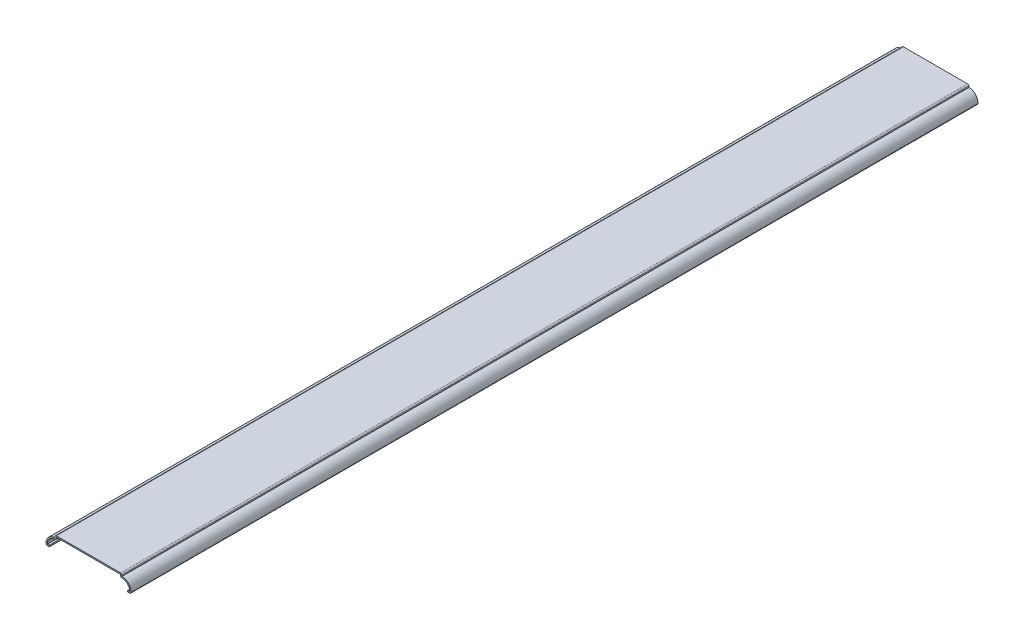
ISO-10303-21;
HEADER;
FILE_DESCRIPTION(('STEP AP214'),'2;1');
FILE_NAME('part.step','',(''),(''),'','','');
FILE_SCHEMA(('AUTOMOTIVE_DESIGN { 1 0 10303 214 1 1 1 1 }'));
ENDSEC;
DATA;
#1=APPLICATION_CONTEXT('core data for automotive mechanical design processes');
#2=APPLICATION_PROTOCOL_DEFINITION('international standard','automotive_design',2000,#1);
#3=PRODUCT_CONTEXT('',#1,'mechanical');
#4=PRODUCT('Part','Part','',(#3));
#5=PRODUCT_RELATED_PRODUCT_CATEGORY('part','',(#4));
#6=PRODUCT_DEFINITION_FORMATION('','',#4);
#7=PRODUCT_DEFINITION_CONTEXT('part definition',#1,'design');
#8=PRODUCT_DEFINITION('design','',#6,#7);
#9=PRODUCT_DEFINITION_SHAPE('','',#8);
#10=(LENGTH_UNIT() NAMED_UNIT(*) SI_UNIT(.MILLI.,.METRE.));
#11=(NAMED_UNIT(*) PLANE_ANGLE_UNIT() SI_UNIT($,.RADIAN.));
#12=(NAMED_UNIT(*) SI_UNIT($,.STERADIAN.) SOLID_ANGLE_UNIT());
#13=UNCERTAINTY_MEASURE_WITH_UNIT(LENGTH_MEASURE(1.E-05),#10,'distance_accuracy_value','');
#14=(GEOMETRIC_REPRESENTATION_CONTEXT(3) GLOBAL_UNCERTAINTY_ASSIGNED_CONTEXT((#13)) GLOBAL_UNIT_ASSIGNED_CONTEXT((#10,
#11,#12)) REPRESENTATION_CONTEXT('',''));
#15=CARTESIAN_POINT('',(0.,0.,0.));
#16=DIRECTION('',(0.,0.,1.));
#17=DIRECTION('',(1.,0.,0.));
#18=AXIS2_PLACEMENT_3D('',#15,#16,#17);
#19=CARTESIAN_POINT('',(-38.1,0.,-825.5));
#20=DIRECTION('',(0.,-1.,0.));
#21=DIRECTION('',(1.,0.,0.));
#22=AXIS2_PLACEMENT_3D('',#19,#20,#21);
#23=PLANE('',#22);
#24=DIRECTION('',(1.,0.,0.));
#25=VECTOR('',#24,1.);
#26=CARTESIAN_POINT('',(-38.1,0.,0.));
#27=LINE('',#26,#25);
#28=CARTESIAN_POINT('',(-40.1439457789629,0.,0.));
#29=VERTEX_POINT('',#28);
#30=CARTESIAN_POINT('',(-38.1,0.,0.));
#31=VERTEX_POINT('',#30);
#32=EDGE_CURVE('E329',#29,#31,#27,.T.);
#33=ORIENTED_EDGE('',*,*,#32,.F.);
#34=DIRECTION('',(0.,0.,1.));
#35=VECTOR('',#34,1.);
#36=CARTESIAN_POINT('',(-40.1439457789629,0.,-825.5));
#37=LINE('',#36,#35);
#38=CARTESIAN_POINT('',(-40.1439457789629,0.,-825.5));
#39=VERTEX_POINT('',#38);
#40=EDGE_CURVE('E193',#29,#39,#37,.F.);
#41=ORIENTED_EDGE('',*,*,#40,.T.);
#42=DIRECTION('',(1.,0.,0.));
#43=VECTOR('',#42,1.);
#44=CARTESIAN_POINT('',(-38.1,0.,-825.5));
#45=LINE('',#44,#43);
#46=CARTESIAN_POINT('',(-38.1,0.,-825.5));
#47=VERTEX_POINT('',#46);
#48=EDGE_CURVE('E186',#39,#47,#45,.T.);
#49=ORIENTED_EDGE('',*,*,#48,.T.);
#50=DIRECTION('',(0.,0.,1.));
#51=VECTOR('',#50,1.);
#52=CARTESIAN_POINT('',(-38.1,0.,-825.5));
#53=LINE('',#52,#51);
#54=EDGE_CURVE('E190',#47,#31,#53,.T.);
#55=ORIENTED_EDGE('',*,*,#54,.T.);
#56=EDGE_LOOP('',(#33,#41,#49,#55));
#57=FACE_BOUND('',#56,.T.);
#58=ADVANCED_FACE('F35',(#57),#23,.T.);
#59=CARTESIAN_POINT('',(-32.6895060790985,1.5887166823141,-825.5));
#60=DIRECTION('',(0.,0.,1.));
#61=DIRECTION('',(1.,0.,0.));
#62=AXIS2_PLACEMENT_3D('',#59,#60,#61);
#63=CYLINDRICAL_SURFACE('',#62,8.73125000000001);
#64=CARTESIAN_POINT('',(-32.6895060790985,1.5887166823141,-825.5));
#65=DIRECTION('',(0.,0.,1.));
#66=DIRECTION('',(-1.,0.,0.));
#67=AXIS2_PLACEMENT_3D('',#64,#65,#66);
#68=CIRCLE('',#67,8.73125000000001);
#69=CARTESIAN_POINT('',(-32.54375,10.31875,-825.5));
#70=VERTEX_POINT('',#69);
#71=CARTESIAN_POINT('',(-41.4127865789398,1.21575035194653,-825.5));
#72=VERTEX_POINT('',#71);
#73=EDGE_CURVE('E210',#70,#72,#68,.T.);
#74=ORIENTED_EDGE('',*,*,#73,.T.);
#75=DIRECTION('',(0.,0.,1.));
#76=VECTOR('',#75,1.);
#77=CARTESIAN_POINT('',(-41.4127865789398,1.21575035194653,-825.5));
#78=LINE('',#77,#76);
#79=CARTESIAN_POINT('',(-41.4127865789398,1.21575035194653,0.));
#80=VERTEX_POINT('',#79);
#81=EDGE_CURVE('E219',#72,#80,#78,.T.);
#82=ORIENTED_EDGE('',*,*,#81,.T.);
#83=CARTESIAN_POINT('',(-32.6895060790985,1.5887166823141,0.));
#84=DIRECTION('',(0.,0.,1.));
#85=DIRECTION('',(-1.,0.,0.));
#86=AXIS2_PLACEMENT_3D('',#83,#84,#85);
#87=CIRCLE('',#86,8.73125000000001);
#88=CARTESIAN_POINT('',(-32.54375,10.31875,0.));
#89=VERTEX_POINT('',#88);
#90=EDGE_CURVE('E196',#89,#80,#87,.T.);
#91=ORIENTED_EDGE('',*,*,#90,.F.);
#92=DIRECTION('',(0.,0.,1.));
#93=VECTOR('',#92,1.);
#94=CARTESIAN_POINT('',(-32.54375,10.31875,-825.5));
#95=LINE('',#94,#93);
#96=EDGE_CURVE('E223',#70,#89,#95,.T.);
#97=ORIENTED_EDGE('',*,*,#96,.F.);
#98=EDGE_LOOP('',(#74,#82,#91,#97));
#99=FACE_BOUND('',#98,.T.);
#100=ADVANCED_FACE('F370',(#99),#63,.T.);
#101=CARTESIAN_POINT('',(-32.54375,10.31875,-825.5));
#102=DIRECTION('',(-1.,0.,0.));
#103=DIRECTION('',(0.,0.,1.));
#104=AXIS2_PLACEMENT_3D('',#101,#102,#103);
#105=PLANE('',#104);
#106=DIRECTION('',(0.,-1.,0.));
#107=VECTOR('',#106,1.);
#108=CARTESIAN_POINT('',(-32.54375,10.31875,0.));
#109=LINE('',#108,#107);
#110=CARTESIAN_POINT('',(-32.54375,11.43,0.));
#111=VERTEX_POINT('',#110);
#112=EDGE_CURVE('E272',#111,#89,#109,.T.);
#113=ORIENTED_EDGE('',*,*,#112,.F.);
#114=DIRECTION('',(0.,0.,1.));
#115=VECTOR('',#114,1.);
#116=CARTESIAN_POINT('',(-32.54375,11.43,-825.5));
#117=LINE('',#116,#115);
#118=CARTESIAN_POINT('',(-32.54375,11.43,-825.5));
#119=VERTEX_POINT('',#118);
#120=EDGE_CURVE('E43',#111,#119,#117,.F.);
#121=ORIENTED_EDGE('',*,*,#120,.T.);
#122=DIRECTION('',(0.,-1.,0.));
#123=VECTOR('',#122,1.);
#124=CARTESIAN_POINT('',(-32.54375,10.31875,-825.5));
#125=LINE('',#124,#123);
#126=EDGE_CURVE('E215',#119,#70,#125,.T.);
#127=ORIENTED_EDGE('',*,*,#126,.T.);
#128=ORIENTED_EDGE('',*,*,#96,.T.);
#129=EDGE_LOOP('',(#113,#121,#127,#128));
#130=FACE_BOUND('',#129,.T.);
#131=ADVANCED_FACE('F269',(#130),#105,.T.);
#132=CARTESIAN_POINT('',(-32.54375,12.7,-825.5));
#133=DIRECTION('',(0.,1.,0.));
#134=DIRECTION('',(0.,0.,1.));
#135=AXIS2_PLACEMENT_3D('',#132,#133,#134);
#136=PLANE('',#135);
#137=DIRECTION('',(-1.,0.,0.));
#138=VECTOR('',#137,1.);
#139=CARTESIAN_POINT('',(-32.54375,12.7,-825.5));
#140=LINE('',#139,#138);
#141=CARTESIAN_POINT('',(31.27375,12.7,-825.5));
#142=VERTEX_POINT('',#141);
#143=CARTESIAN_POINT('',(-31.27375,12.7,-825.5));
#144=VERTEX_POINT('',#143);
#145=EDGE_CURVE('E278',#142,#144,#140,.T.);
#146=ORIENTED_EDGE('',*,*,#145,.T.);
#147=DIRECTION('',(0.,0.,1.));
#148=VECTOR('',#147,1.);
#149=CARTESIAN_POINT('',(-31.27375,12.7,-825.5));
#150=LINE('',#149,#148);
#151=CARTESIAN_POINT('',(-31.27375,12.7,0.));
#152=VERTEX_POINT('',#151);
#153=EDGE_CURVE('E263',#144,#152,#150,.T.);
#154=ORIENTED_EDGE('',*,*,#153,.T.);
#155=DIRECTION('',(-1.,0.,0.));
#156=VECTOR('',#155,1.);
#157=CARTESIAN_POINT('',(-32.54375,12.7,0.));
#158=LINE('',#157,#156);
#159=CARTESIAN_POINT('',(31.27375,12.7,0.));
#160=VERTEX_POINT('',#159);
#161=EDGE_CURVE('E286',#160,#152,#158,.T.);
#162=ORIENTED_EDGE('',*,*,#161,.F.);
#163=DIRECTION('',(0.,0.,1.));
#164=VECTOR('',#163,1.);
#165=CARTESIAN_POINT('',(31.27375,12.7,-825.5));
#166=LINE('',#165,#164);
#167=EDGE_CURVE('E261',#160,#142,#166,.F.);
#168=ORIENTED_EDGE('',*,*,#167,.T.);
#169=EDGE_LOOP('',(#146,#154,#162,#168));
#170=FACE_BOUND('',#169,.T.);
#171=ADVANCED_FACE('F285',(#170),#136,.T.);
#172=CARTESIAN_POINT('',(32.54375,10.31875,-825.5));
#173=DIRECTION('',(1.,0.,0.));
#174=DIRECTION('',(0.,0.,-1.));
#175=AXIS2_PLACEMENT_3D('',#172,#173,#174);
#176=PLANE('',#175);
#177=DIRECTION('',(0.,1.,0.));
#178=VECTOR('',#177,1.);
#179=CARTESIAN_POINT('',(32.54375,10.31875,-825.5));
#180=LINE('',#179,#178);
#181=CARTESIAN_POINT('',(32.54375,10.31875,-825.5));
#182=VERTEX_POINT('',#181);
#183=CARTESIAN_POINT('',(32.54375,11.43,-825.5));
#184=VERTEX_POINT('',#183);
#185=EDGE_CURVE('E360',#182,#184,#180,.T.);
#186=ORIENTED_EDGE('',*,*,#185,.T.);
#187=DIRECTION('',(0.,0.,1.));
#188=VECTOR('',#187,1.);
#189=CARTESIAN_POINT('',(32.54375,11.43,-825.5));
#190=LINE('',#189,#188);
#191=CARTESIAN_POINT('',(32.54375,11.43,0.));
#192=VERTEX_POINT('',#191);
#193=EDGE_CURVE('E11',#184,#192,#190,.T.);
#194=ORIENTED_EDGE('',*,*,#193,.T.);
#195=DIRECTION('',(0.,1.,0.));
#196=VECTOR('',#195,1.);
#197=CARTESIAN_POINT('',(32.54375,10.31875,0.));
#198=LINE('',#197,#196);
#199=CARTESIAN_POINT('',(32.54375,10.31875,0.));
#200=VERTEX_POINT('',#199);
#201=EDGE_CURVE('E292',#200,#192,#198,.T.);
#202=ORIENTED_EDGE('',*,*,#201,.F.);
#203=DIRECTION('',(0.,0.,1.));
#204=VECTOR('',#203,1.);
#205=CARTESIAN_POINT('',(32.54375,10.31875,-825.5));
#206=LINE('',#205,#204);
#207=EDGE_CURVE('E301',#182,#200,#206,.T.);
#208=ORIENTED_EDGE('',*,*,#207,.F.);
#209=EDGE_LOOP('',(#186,#194,#202,#208));
#210=FACE_BOUND('',#209,.T.);
#211=ADVANCED_FACE('F358',(#210),#176,.T.);
#212=CARTESIAN_POINT('',(32.6895060790985,1.5887166823141,-825.5));
#213=DIRECTION('',(0.,0.,1.));
#214=DIRECTION('',(1.,0.,0.));
#215=AXIS2_PLACEMENT_3D('',#212,#213,#214);
#216=CYLINDRICAL_SURFACE('',#215,8.73125000000001);
#217=CARTESIAN_POINT('',(32.6895060790985,1.5887166823141,0.));
#218=DIRECTION('',(0.,0.,1.));
#219=DIRECTION('',(1.,0.,0.));
#220=AXIS2_PLACEMENT_3D('',#217,#218,#219);
#221=CIRCLE('',#220,8.73125000000001);
#222=CARTESIAN_POINT('',(41.4127865789398,1.21575035194653,0.));
#223=VERTEX_POINT('',#222);
#224=EDGE_CURVE('E295',#223,#200,#221,.T.);
#225=ORIENTED_EDGE('',*,*,#224,.F.);
#226=DIRECTION('',(0.,0.,1.));
#227=VECTOR('',#226,1.);
#228=CARTESIAN_POINT('',(41.4127865789398,1.21575035194653,-825.5));
#229=LINE('',#228,#227);
#230=CARTESIAN_POINT('',(41.4127865789398,1.21575035194653,-825.5));
#231=VERTEX_POINT('',#230);
#232=EDGE_CURVE('E250',#223,#231,#229,.F.);
#233=ORIENTED_EDGE('',*,*,#232,.T.);
#234=CARTESIAN_POINT('',(32.6895060790985,1.5887166823141,-825.5));
#235=DIRECTION('',(0.,0.,1.));
#236=DIRECTION('',(1.,0.,0.));
#237=AXIS2_PLACEMENT_3D('',#234,#235,#236);
#238=CIRCLE('',#237,8.73125000000001);
#239=EDGE_CURVE('E354',#231,#182,#238,.T.);
#240=ORIENTED_EDGE('',*,*,#239,.T.);
#241=ORIENTED_EDGE('',*,*,#207,.T.);
#242=EDGE_LOOP('',(#225,#233,#240,#241));
#243=FACE_BOUND('',#242,.T.);
#244=ADVANCED_FACE('F352',(#243),#216,.T.);
#245=CARTESIAN_POINT('',(38.1,0.,-825.5));
#246=DIRECTION('',(0.,-1.,0.));
#247=DIRECTION('',(1.,0.,0.));
#248=AXIS2_PLACEMENT_3D('',#245,#246,#247);
#249=PLANE('',#248);
#250=DIRECTION('',(1.,0.,0.));
#251=VECTOR('',#250,1.);
#252=CARTESIAN_POINT('',(38.1,0.,-825.5));
#253=LINE('',#252,#251);
#254=CARTESIAN_POINT('',(38.1,0.,-825.5));
#255=VERTEX_POINT('',#254);
#256=CARTESIAN_POINT('',(40.1439457789629,0.,-825.5));
#257=VERTEX_POINT('',#256);
#258=EDGE_CURVE('E602',#255,#257,#253,.T.);
#259=ORIENTED_EDGE('',*,*,#258,.T.);
#260=DIRECTION('',(0.,0.,1.));
#261=VECTOR('',#260,1.);
#262=CARTESIAN_POINT('',(40.1439457789629,0.,-825.5));
#263=LINE('',#262,#261);
#264=CARTESIAN_POINT('',(40.1439457789629,0.,0.));
#265=VERTEX_POINT('',#264);
#266=EDGE_CURVE('E247',#257,#265,#263,.T.);
#267=ORIENTED_EDGE('',*,*,#266,.T.);
#268=DIRECTION('',(1.,0.,0.));
#269=VECTOR('',#268,1.);
#270=CARTESIAN_POINT('',(38.1,0.,0.));
#271=LINE('',#270,#269);
#272=CARTESIAN_POINT('',(38.1,0.,0.));
#273=VERTEX_POINT('',#272);
#274=EDGE_CURVE('E345',#273,#265,#271,.T.);
#275=ORIENTED_EDGE('',*,*,#274,.F.);
#276=DIRECTION('',(0.,0.,1.));
#277=VECTOR('',#276,1.);
#278=CARTESIAN_POINT('',(38.1,0.,-825.5));
#279=LINE('',#278,#277);
#280=EDGE_CURVE('E304',#255,#273,#279,.T.);
#281=ORIENTED_EDGE('',*,*,#280,.F.);
#282=EDGE_LOOP('',(#259,#267,#275,#281));
#283=FACE_BOUND('',#282,.T.);
#284=ADVANCED_FACE('F389',(#283),#249,.T.);
#285=CARTESIAN_POINT('',(38.1,0.,-825.5));
#286=DIRECTION('',(1.,0.,0.));
#287=DIRECTION('',(0.,0.,-1.));
#288=AXIS2_PLACEMENT_3D('',#285,#286,#287);
#289=PLANE('',#288);
#290=DIRECTION('',(0.,1.,0.));
#291=VECTOR('',#290,1.);
#292=CARTESIAN_POINT('',(38.1,0.,0.));
#293=LINE('',#292,#291);
#294=CARTESIAN_POINT('',(38.1,1.27,0.));
#295=VERTEX_POINT('',#294);
#296=EDGE_CURVE('E343',#273,#295,#293,.T.);
#297=ORIENTED_EDGE('',*,*,#296,.T.);
#298=DIRECTION('',(0.,0.,1.));
#299=VECTOR('',#298,1.);
#300=CARTESIAN_POINT('',(38.1,1.27,-825.5));
#301=LINE('',#300,#299);
#302=CARTESIAN_POINT('',(38.1,1.27,-825.5));
#303=VERTEX_POINT('',#302);
#304=EDGE_CURVE('E306',#303,#295,#301,.T.);
#305=ORIENTED_EDGE('',*,*,#304,.F.);
#306=DIRECTION('',(0.,1.,0.));
#307=VECTOR('',#306,1.);
#308=CARTESIAN_POINT('',(38.1,0.,-825.5));
#309=LINE('',#308,#307);
#310=EDGE_CURVE('E600',#255,#303,#309,.T.);
#311=ORIENTED_EDGE('',*,*,#310,.F.);
#312=ORIENTED_EDGE('',*,*,#280,.T.);
#313=EDGE_LOOP('',(#297,#305,#311,#312));
#314=FACE_BOUND('',#313,.T.);
#315=ADVANCED_FACE('F392',(#314),#289,.F.);
#316=CARTESIAN_POINT('',(38.1,1.27,-825.5));
#317=DIRECTION('',(0.,-1.,0.));
#318=DIRECTION('',(1.,0.,0.));
#319=AXIS2_PLACEMENT_3D('',#316,#317,#318);
#320=PLANE('',#319);
#321=DIRECTION('',(1.,0.,0.));
#322=VECTOR('',#321,1.);
#323=CARTESIAN_POINT('',(38.1,1.27,0.));
#324=LINE('',#323,#322);
#325=CARTESIAN_POINT('',(40.1439457789629,1.27,0.));
#326=VERTEX_POINT('',#325);
#327=EDGE_CURVE('E341',#295,#326,#324,.T.);
#328=ORIENTED_EDGE('',*,*,#327,.T.);
#329=DIRECTION('',(0.,0.,1.));
#330=VECTOR('',#329,1.);
#331=CARTESIAN_POINT('',(40.1439457789629,1.27,-825.5));
#332=LINE('',#331,#330);
#333=CARTESIAN_POINT('',(40.1439457789629,1.27,-825.5));
#334=VERTEX_POINT('',#333);
#335=EDGE_CURVE('E309',#334,#326,#332,.T.);
#336=ORIENTED_EDGE('',*,*,#335,.F.);
#337=DIRECTION('',(1.,0.,0.));
#338=VECTOR('',#337,1.);
#339=CARTESIAN_POINT('',(38.1,1.27,-825.5));
#340=LINE('',#339,#338);
#341=EDGE_CURVE('E598',#303,#334,#340,.T.);
#342=ORIENTED_EDGE('',*,*,#341,.F.);
#343=ORIENTED_EDGE('',*,*,#304,.T.);
#344=EDGE_LOOP('',(#328,#336,#342,#343));
#345=FACE_BOUND('',#344,.T.);
#346=ADVANCED_FACE('F396',(#345),#320,.F.);
#347=CARTESIAN_POINT('',(32.6895060790985,1.5887166823141,-825.5));
#348=DIRECTION('',(0.,0.,1.));
#349=DIRECTION('',(1.,0.,0.));
#350=AXIS2_PLACEMENT_3D('',#347,#348,#349);
#351=CYLINDRICAL_SURFACE('',#350,7.46125000000001);
#352=CARTESIAN_POINT('',(32.6895060790985,1.5887166823141,0.));
#353=DIRECTION('',(0.,0.,1.));
#354=DIRECTION('',(1.,0.,0.));
#355=AXIS2_PLACEMENT_3D('',#352,#353,#354);
#356=CIRCLE('',#355,7.46125000000001);
#357=CARTESIAN_POINT('',(32.5649508842325,9.04892697197296,0.));
#358=VERTEX_POINT('',#357);
#359=EDGE_CURVE('E338',#326,#358,#356,.T.);
#360=ORIENTED_EDGE('',*,*,#359,.T.);
#361=DIRECTION('',(0.,0.,1.));
#362=VECTOR('',#361,1.);
#363=CARTESIAN_POINT('',(32.5649508842325,9.04892697197296,-825.5));
#364=LINE('',#363,#362);
#365=CARTESIAN_POINT('',(32.5649508842325,9.04892697197296,-825.5));
#366=VERTEX_POINT('',#365);
#367=EDGE_CURVE('E255',#358,#366,#364,.F.);
#368=ORIENTED_EDGE('',*,*,#367,.T.);
#369=CARTESIAN_POINT('',(32.6895060790985,1.5887166823141,-825.5));
#370=DIRECTION('',(0.,0.,1.));
#371=DIRECTION('',(1.,0.,0.));
#372=AXIS2_PLACEMENT_3D('',#369,#370,#371);
#373=CIRCLE('',#372,7.46125000000001);
#374=EDGE_CURVE('E595',#334,#366,#373,.T.);
#375=ORIENTED_EDGE('',*,*,#374,.F.);
#376=ORIENTED_EDGE('',*,*,#335,.T.);
#377=EDGE_LOOP('',(#360,#368,#375,#376));
#378=FACE_BOUND('',#377,.T.);
#379=ADVANCED_FACE('F400',(#378),#351,.F.);
#380=CARTESIAN_POINT('',(31.27375,10.31875,-825.5));
#381=DIRECTION('',(1.,0.,0.));
#382=DIRECTION('',(0.,0.,-1.));
#383=AXIS2_PLACEMENT_3D('',#380,#381,#382);
#384=PLANE('',#383);
#385=DIRECTION('',(0.,1.,0.));
#386=VECTOR('',#385,1.);
#387=CARTESIAN_POINT('',(31.27375,10.31875,-825.5));
#388=LINE('',#387,#386);
#389=CARTESIAN_POINT('',(31.27375,10.31875,-825.5));
#390=VERTEX_POINT('',#389);
#391=CARTESIAN_POINT('',(31.27375,11.43,-825.5));
#392=VERTEX_POINT('',#391);
#393=EDGE_CURVE('E593',#390,#392,#388,.T.);
#394=ORIENTED_EDGE('',*,*,#393,.F.);
#395=DIRECTION('',(0.,0.,1.));
#396=VECTOR('',#395,1.);
#397=CARTESIAN_POINT('',(31.27375,10.31875,-825.5));
#398=LINE('',#397,#396);
#399=CARTESIAN_POINT('',(31.27375,10.31875,0.));
#400=VERTEX_POINT('',#399);
#401=EDGE_CURVE('E252',#390,#400,#398,.T.);
#402=ORIENTED_EDGE('',*,*,#401,.T.);
#403=DIRECTION('',(0.,1.,0.));
#404=VECTOR('',#403,1.);
#405=CARTESIAN_POINT('',(31.27375,10.31875,0.));
#406=LINE('',#405,#404);
#407=CARTESIAN_POINT('',(31.27375,11.43,0.));
#408=VERTEX_POINT('',#407);
#409=EDGE_CURVE('E336',#400,#408,#406,.T.);
#410=ORIENTED_EDGE('',*,*,#409,.T.);
#411=DIRECTION('',(0.,0.,1.));
#412=VECTOR('',#411,1.);
#413=CARTESIAN_POINT('',(31.27375,11.43,-825.5));
#414=LINE('',#413,#412);
#415=EDGE_CURVE('E312',#392,#408,#414,.T.);
#416=ORIENTED_EDGE('',*,*,#415,.F.);
#417=EDGE_LOOP('',(#394,#402,#410,#416));
#418=FACE_BOUND('',#417,.T.);
#419=ADVANCED_FACE('F404',(#418),#384,.F.);
#420=CARTESIAN_POINT('',(-32.54375,11.43,-825.5));
#421=DIRECTION('',(0.,1.,0.));
#422=DIRECTION('',(0.,0.,1.));
#423=AXIS2_PLACEMENT_3D('',#420,#421,#422);
#424=PLANE('',#423);
#425=DIRECTION('',(1.,0.,0.));
#426=VECTOR('',#425,1.);
#427=CARTESIAN_POINT('',(-32.54375,11.43,0.));
#428=LINE('',#427,#426);
#429=CARTESIAN_POINT('',(-31.27375,11.43,0.));
#430=VERTEX_POINT('',#429);
#431=EDGE_CURVE('E334',#408,#430,#428,.F.);
#432=ORIENTED_EDGE('',*,*,#431,.T.);
#433=DIRECTION('',(0.,0.,1.));
#434=VECTOR('',#433,1.);
#435=CARTESIAN_POINT('',(-31.27375,11.43,-825.5));
#436=LINE('',#435,#434);
#437=CARTESIAN_POINT('',(-31.27375,11.43,-825.5));
#438=VERTEX_POINT('',#437);
#439=EDGE_CURVE('E315',#438,#430,#436,.T.);
#440=ORIENTED_EDGE('',*,*,#439,.F.);
#441=DIRECTION('',(1.,0.,0.));
#442=VECTOR('',#441,1.);
#443=CARTESIAN_POINT('',(-32.54375,11.43,-825.5));
#444=LINE('',#443,#442);
#445=EDGE_CURVE('E588',#392,#438,#444,.F.);
#446=ORIENTED_EDGE('',*,*,#445,.F.);
#447=ORIENTED_EDGE('',*,*,#415,.T.);
#448=EDGE_LOOP('',(#432,#440,#446,#447));
#449=FACE_BOUND('',#448,.T.);
#450=ADVANCED_FACE('F408',(#449),#424,.F.);
#451=CARTESIAN_POINT('',(-31.27375,10.31875,-825.5));
#452=DIRECTION('',(-1.,0.,0.));
#453=DIRECTION('',(0.,0.,1.));
#454=AXIS2_PLACEMENT_3D('',#451,#452,#453);
#455=PLANE('',#454);
#456=DIRECTION('',(0.,1.,0.));
#457=VECTOR('',#456,1.);
#458=CARTESIAN_POINT('',(-31.27375,10.31875,0.));
#459=LINE('',#458,#457);
#460=CARTESIAN_POINT('',(-31.27375,10.31875,0.));
#461=VERTEX_POINT('',#460);
#462=EDGE_CURVE('E327',#430,#461,#459,.F.);
#463=ORIENTED_EDGE('',*,*,#462,.T.);
#464=DIRECTION('',(0.,0.,1.));
#465=VECTOR('',#464,1.);
#466=CARTESIAN_POINT('',(-31.27375,10.31875,-825.5));
#467=LINE('',#466,#465);
#468=CARTESIAN_POINT('',(-31.27375,10.31875,-825.5));
#469=VERTEX_POINT('',#468);
#470=EDGE_CURVE('E58',#461,#469,#467,.F.);
#471=ORIENTED_EDGE('',*,*,#470,.T.);
#472=DIRECTION('',(0.,1.,0.));
#473=VECTOR('',#472,1.);
#474=CARTESIAN_POINT('',(-31.27375,10.31875,-825.5));
#475=LINE('',#474,#473);
#476=EDGE_CURVE('E586',#438,#469,#475,.F.);
#477=ORIENTED_EDGE('',*,*,#476,.F.);
#478=ORIENTED_EDGE('',*,*,#439,.T.);
#479=EDGE_LOOP('',(#463,#471,#477,#478));
#480=FACE_BOUND('',#479,.T.);
#481=ADVANCED_FACE('F412',(#480),#455,.F.);
#482=CARTESIAN_POINT('',(-32.6895060790985,1.5887166823141,-825.5));
#483=DIRECTION('',(0.,0.,1.));
#484=DIRECTION('',(1.,0.,0.));
#485=AXIS2_PLACEMENT_3D('',#482,#483,#484);
#486=CYLINDRICAL_SURFACE('',#485,7.46125000000001);
#487=CARTESIAN_POINT('',(-32.6895060790985,1.5887166823141,-825.5));
#488=DIRECTION('',(0.,0.,1.));
#489=DIRECTION('',(1.,0.,0.));
#490=AXIS2_PLACEMENT_3D('',#487,#488,#489);
#491=CIRCLE('',#490,7.46125000000001);
#492=CARTESIAN_POINT('',(-32.5649508842325,9.04892697197296,-825.5));
#493=VERTEX_POINT('',#492);
#494=CARTESIAN_POINT('',(-40.1439457789629,1.27,-825.5));
#495=VERTEX_POINT('',#494);
#496=EDGE_CURVE('E585',#493,#495,#491,.T.);
#497=ORIENTED_EDGE('',*,*,#496,.F.);
#498=DIRECTION('',(0.,0.,1.));
#499=VECTOR('',#498,1.);
#500=CARTESIAN_POINT('',(-32.5649508842325,9.04892697197296,-825.5));
#501=LINE('',#500,#499);
#502=CARTESIAN_POINT('',(-32.5649508842325,9.04892697197296,0.));
#503=VERTEX_POINT('',#502);
#504=EDGE_CURVE('E257',#493,#503,#501,.T.);
#505=ORIENTED_EDGE('',*,*,#504,.T.);
#506=CARTESIAN_POINT('',(-32.6895060790985,1.5887166823141,0.));
#507=DIRECTION('',(0.,0.,1.));
#508=DIRECTION('',(1.,0.,0.));
#509=AXIS2_PLACEMENT_3D('',#506,#507,#508);
#510=CIRCLE('',#509,7.46125000000001);
#511=CARTESIAN_POINT('',(-40.1439457789629,1.27,0.));
#512=VERTEX_POINT('',#511);
#513=EDGE_CURVE('E325',#503,#512,#510,.T.);
#514=ORIENTED_EDGE('',*,*,#513,.T.);
#515=DIRECTION('',(0.,0.,1.));
#516=VECTOR('',#515,1.);
#517=CARTESIAN_POINT('',(-40.1439457789629,1.27,-825.5));
#518=LINE('',#517,#516);
#519=EDGE_CURVE('E212',#495,#512,#518,.T.);
#520=ORIENTED_EDGE('',*,*,#519,.F.);
#521=EDGE_LOOP('',(#497,#505,#514,#520));
#522=FACE_BOUND('',#521,.T.);
#523=ADVANCED_FACE('F416',(#522),#486,.F.);
#524=CARTESIAN_POINT('',(-38.1,1.27,-825.5));
#525=DIRECTION('',(0.,-1.,0.));
#526=DIRECTION('',(1.,0.,0.));
#527=AXIS2_PLACEMENT_3D('',#524,#525,#526);
#528=PLANE('',#527);
#529=DIRECTION('',(1.,0.,0.));
#530=VECTOR('',#529,1.);
#531=CARTESIAN_POINT('',(-38.1,1.27,0.));
#532=LINE('',#531,#530);
#533=CARTESIAN_POINT('',(-38.1,1.27,0.));
#534=VERTEX_POINT('',#533);
#535=EDGE_CURVE('E322',#512,#534,#532,.T.);
#536=ORIENTED_EDGE('',*,*,#535,.T.);
#537=DIRECTION('',(0.,0.,1.));
#538=VECTOR('',#537,1.);
#539=CARTESIAN_POINT('',(-38.1,1.27,-825.5));
#540=LINE('',#539,#538);
#541=CARTESIAN_POINT('',(-38.1,1.27,-825.5));
#542=VERTEX_POINT('',#541);
#543=EDGE_CURVE('E209',#542,#534,#540,.T.);
#544=ORIENTED_EDGE('',*,*,#543,.F.);
#545=DIRECTION('',(1.,0.,0.));
#546=VECTOR('',#545,1.);
#547=CARTESIAN_POINT('',(-38.1,1.27,-825.5));
#548=LINE('',#547,#546);
#549=EDGE_CURVE('E201',#495,#542,#548,.T.);
#550=ORIENTED_EDGE('',*,*,#549,.F.);
#551=ORIENTED_EDGE('',*,*,#519,.T.);
#552=EDGE_LOOP('',(#536,#544,#550,#551));
#553=FACE_BOUND('',#552,.T.);
#554=ADVANCED_FACE('F321',(#553),#528,.F.);
#555=CARTESIAN_POINT('',(-38.1,1.27,-825.5));
#556=DIRECTION('',(-1.,0.,0.));
#557=DIRECTION('',(0.,0.,1.));
#558=AXIS2_PLACEMENT_3D('',#555,#556,#557);
#559=PLANE('',#558);
#560=DIRECTION('',(0.,-1.,0.));
#561=VECTOR('',#560,1.);
#562=CARTESIAN_POINT('',(-38.1,1.27,0.));
#563=LINE('',#562,#561);
#564=EDGE_CURVE('E208',#534,#31,#563,.T.);
#565=ORIENTED_EDGE('',*,*,#564,.T.);
#566=ORIENTED_EDGE('',*,*,#54,.F.);
#567=DIRECTION('',(0.,-1.,0.));
#568=VECTOR('',#567,1.);
#569=CARTESIAN_POINT('',(-38.1,1.27,-825.5));
#570=LINE('',#569,#568);
#571=EDGE_CURVE('E195',#542,#47,#570,.T.);
#572=ORIENTED_EDGE('',*,*,#571,.F.);
#573=ORIENTED_EDGE('',*,*,#543,.T.);
#574=EDGE_LOOP('',(#565,#566,#572,#573));
#575=FACE_BOUND('',#574,.T.);
#576=ADVANCED_FACE('F206',(#575),#559,.F.);
#577=CARTESIAN_POINT('',(-32.6895060790985,1.5887166823141,-825.5));
#578=DIRECTION('',(0.,0.,1.));
#579=DIRECTION('',(1.,0.,0.));
#580=AXIS2_PLACEMENT_3D('',#577,#578,#579);
#581=PLANE('',#580);
#582=ORIENTED_EDGE('',*,*,#48,.F.);
#583=CARTESIAN_POINT('',(-40.1439457789629,1.27,-825.5));
#584=DIRECTION('',(0.,0.,1.));
#585=DIRECTION('',(1.,0.,0.));
#586=AXIS2_PLACEMENT_3D('',#583,#584,#585);
#587=CIRCLE('',#586,1.27);
#588=EDGE_CURVE('E245',#39,#72,#587,.F.);
#589=ORIENTED_EDGE('',*,*,#588,.T.);
#590=ORIENTED_EDGE('',*,*,#73,.F.);
#591=ORIENTED_EDGE('',*,*,#126,.F.);
#592=CARTESIAN_POINT('',(-31.27375,11.43,-825.5));
#593=DIRECTION('',(0.,0.,1.));
#594=DIRECTION('',(1.,0.,0.));
#595=AXIS2_PLACEMENT_3D('',#592,#593,#594);
#596=CIRCLE('',#595,1.27);
#597=EDGE_CURVE('E238',#119,#144,#596,.F.);
#598=ORIENTED_EDGE('',*,*,#597,.T.);
#599=ORIENTED_EDGE('',*,*,#145,.F.);
#600=CARTESIAN_POINT('',(31.27375,11.43,-825.5));
#601=DIRECTION('',(0.,0.,1.));
#602=DIRECTION('',(1.,0.,0.));
#603=AXIS2_PLACEMENT_3D('',#600,#601,#602);
#604=CIRCLE('',#603,1.27);
#605=EDGE_CURVE('E236',#142,#184,#604,.F.);
#606=ORIENTED_EDGE('',*,*,#605,.T.);
#607=ORIENTED_EDGE('',*,*,#185,.F.);
#608=ORIENTED_EDGE('',*,*,#239,.F.);
#609=CARTESIAN_POINT('',(40.1439457789629,1.27,-825.5));
#610=DIRECTION('',(0.,0.,1.));
#611=DIRECTION('',(1.,0.,0.));
#612=AXIS2_PLACEMENT_3D('',#609,#610,#611);
#613=CIRCLE('',#612,1.27);
#614=EDGE_CURVE('E243',#231,#257,#613,.F.);
#615=ORIENTED_EDGE('',*,*,#614,.T.);
#616=ORIENTED_EDGE('',*,*,#258,.F.);
#617=ORIENTED_EDGE('',*,*,#310,.T.);
#618=ORIENTED_EDGE('',*,*,#341,.T.);
#619=ORIENTED_EDGE('',*,*,#374,.T.);
#620=CARTESIAN_POINT('',(32.54375,10.31875,-825.5));
#621=DIRECTION('',(0.,0.,1.));
#622=DIRECTION('',(1.,0.,0.));
#623=AXIS2_PLACEMENT_3D('',#620,#621,#622);
#624=CIRCLE('',#623,1.27);
#625=EDGE_CURVE('E241',#366,#390,#624,.F.);
#626=ORIENTED_EDGE('',*,*,#625,.T.);
#627=ORIENTED_EDGE('',*,*,#393,.T.);
#628=ORIENTED_EDGE('',*,*,#445,.T.);
#629=ORIENTED_EDGE('',*,*,#476,.T.);
#630=CARTESIAN_POINT('',(-32.54375,10.31875,-825.5));
#631=DIRECTION('',(0.,0.,1.));
#632=DIRECTION('',(1.,0.,0.));
#633=AXIS2_PLACEMENT_3D('',#630,#631,#632);
#634=CIRCLE('',#633,1.27);
#635=EDGE_CURVE('E50',#469,#493,#634,.F.);
#636=ORIENTED_EDGE('',*,*,#635,.T.);
#637=ORIENTED_EDGE('',*,*,#496,.T.);
#638=ORIENTED_EDGE('',*,*,#549,.T.);
#639=ORIENTED_EDGE('',*,*,#571,.T.);
#640=EDGE_LOOP('',(#582,#589,#590,#591,#598,#599,#606,#607,#608,#615,#616,#617,#618,#619,#626,
#627,#628,#629,#636,#637,#638,#639));
#641=FACE_BOUND('',#640,.T.);
#642=ADVANCED_FACE('F199',(#641),#581,.F.);
#643=CARTESIAN_POINT('',(-32.6895060790985,1.5887166823141,0.));
#644=DIRECTION('',(0.,0.,1.));
#645=DIRECTION('',(1.,0.,0.));
#646=AXIS2_PLACEMENT_3D('',#643,#644,#645);
#647=PLANE('',#646);
#648=ORIENTED_EDGE('',*,*,#90,.T.);
#649=CARTESIAN_POINT('',(-40.1439457789629,1.27,0.));
#650=DIRECTION('',(0.,0.,1.));
#651=DIRECTION('',(1.,0.,0.));
#652=AXIS2_PLACEMENT_3D('',#649,#650,#651);
#653=CIRCLE('',#652,1.27);
#654=EDGE_CURVE('E233',#80,#29,#653,.T.);
#655=ORIENTED_EDGE('',*,*,#654,.T.);
#656=ORIENTED_EDGE('',*,*,#32,.T.);
#657=ORIENTED_EDGE('',*,*,#564,.F.);
#658=ORIENTED_EDGE('',*,*,#535,.F.);
#659=ORIENTED_EDGE('',*,*,#513,.F.);
#660=CARTESIAN_POINT('',(-32.54375,10.31875,0.));
#661=DIRECTION('',(0.,0.,1.));
#662=DIRECTION('',(1.,0.,0.));
#663=AXIS2_PLACEMENT_3D('',#660,#661,#662);
#664=CIRCLE('',#663,1.27);
#665=EDGE_CURVE('E227',#503,#461,#664,.T.);
#666=ORIENTED_EDGE('',*,*,#665,.T.);
#667=ORIENTED_EDGE('',*,*,#462,.F.);
#668=ORIENTED_EDGE('',*,*,#431,.F.);
#669=ORIENTED_EDGE('',*,*,#409,.F.);
#670=CARTESIAN_POINT('',(32.54375,10.31875,0.));
#671=DIRECTION('',(0.,0.,1.));
#672=DIRECTION('',(1.,0.,0.));
#673=AXIS2_PLACEMENT_3D('',#670,#671,#672);
#674=CIRCLE('',#673,1.27);
#675=EDGE_CURVE('E229',#400,#358,#674,.T.);
#676=ORIENTED_EDGE('',*,*,#675,.T.);
#677=ORIENTED_EDGE('',*,*,#359,.F.);
#678=ORIENTED_EDGE('',*,*,#327,.F.);
#679=ORIENTED_EDGE('',*,*,#296,.F.);
#680=ORIENTED_EDGE('',*,*,#274,.T.);
#681=CARTESIAN_POINT('',(40.1439457789629,1.27,0.));
#682=DIRECTION('',(0.,0.,1.));
#683=DIRECTION('',(1.,0.,0.));
#684=AXIS2_PLACEMENT_3D('',#681,#682,#683);
#685=CIRCLE('',#684,1.27);
#686=EDGE_CURVE('E231',#265,#223,#685,.T.);
#687=ORIENTED_EDGE('',*,*,#686,.T.);
#688=ORIENTED_EDGE('',*,*,#224,.T.);
#689=ORIENTED_EDGE('',*,*,#201,.T.);
#690=CARTESIAN_POINT('',(31.27375,11.43,0.));
#691=DIRECTION('',(0.,0.,1.));
#692=DIRECTION('',(1.,0.,0.));
#693=AXIS2_PLACEMENT_3D('',#690,#691,#692);
#694=CIRCLE('',#693,1.27);
#695=EDGE_CURVE('E222',#192,#160,#694,.T.);
#696=ORIENTED_EDGE('',*,*,#695,.T.);
#697=ORIENTED_EDGE('',*,*,#161,.T.);
#698=CARTESIAN_POINT('',(-31.27375,11.43,0.));
#699=DIRECTION('',(0.,0.,1.));
#700=DIRECTION('',(1.,0.,0.));
#701=AXIS2_PLACEMENT_3D('',#698,#699,#700);
#702=CIRCLE('',#701,1.27);
#703=EDGE_CURVE('E225',#152,#111,#702,.T.);
#704=ORIENTED_EDGE('',*,*,#703,.T.);
#705=ORIENTED_EDGE('',*,*,#112,.T.);
#706=EDGE_LOOP('',(#648,#655,#656,#657,#658,#659,#666,#667,#668,#669,#676,#677,#678,#679,#680,
#687,#688,#689,#696,#697,#704,#705));
#707=FACE_BOUND('',#706,.T.);
#708=ADVANCED_FACE('F290',(#707),#647,.T.);
#709=CARTESIAN_POINT('',(-40.1439457789629,1.27,-825.5));
#710=DIRECTION('',(0.,0.,1.));
#711=DIRECTION('',(1.,0.,0.));
#712=AXIS2_PLACEMENT_3D('',#709,#710,#711);
#713=CYLINDRICAL_SURFACE('',#712,1.27);
#714=ORIENTED_EDGE('',*,*,#588,.F.);
#715=ORIENTED_EDGE('',*,*,#40,.F.);
#716=ORIENTED_EDGE('',*,*,#654,.F.);
#717=ORIENTED_EDGE('',*,*,#81,.F.);
#718=EDGE_LOOP('',(#714,#715,#716,#717));
#719=FACE_BOUND('',#718,.T.);
#720=ADVANCED_FACE('F367',(#719),#713,.T.);
#721=CARTESIAN_POINT('',(40.1439457789629,1.27,-825.5));
#722=DIRECTION('',(0.,0.,1.));
#723=DIRECTION('',(1.,0.,0.));
#724=AXIS2_PLACEMENT_3D('',#721,#722,#723);
#725=CYLINDRICAL_SURFACE('',#724,1.27);
#726=ORIENTED_EDGE('',*,*,#614,.F.);
#727=ORIENTED_EDGE('',*,*,#232,.F.);
#728=ORIENTED_EDGE('',*,*,#686,.F.);
#729=ORIENTED_EDGE('',*,*,#266,.F.);
#730=EDGE_LOOP('',(#726,#727,#728,#729));
#731=FACE_BOUND('',#730,.T.);
#732=ADVANCED_FACE('F425',(#731),#725,.T.);
#733=CARTESIAN_POINT('',(32.54375,10.31875,-825.5));
#734=DIRECTION('',(0.,0.,1.));
#735=DIRECTION('',(1.,0.,0.));
#736=AXIS2_PLACEMENT_3D('',#733,#734,#735);
#737=CYLINDRICAL_SURFACE('',#736,1.27);
#738=ORIENTED_EDGE('',*,*,#625,.F.);
#739=ORIENTED_EDGE('',*,*,#367,.F.);
#740=ORIENTED_EDGE('',*,*,#675,.F.);
#741=ORIENTED_EDGE('',*,*,#401,.F.);
#742=EDGE_LOOP('',(#738,#739,#740,#741));
#743=FACE_BOUND('',#742,.T.);
#744=ADVANCED_FACE('F428',(#743),#737,.T.);
#745=CARTESIAN_POINT('',(-32.54375,10.31875,-825.5));
#746=DIRECTION('',(0.,0.,1.));
#747=DIRECTION('',(1.,0.,0.));
#748=AXIS2_PLACEMENT_3D('',#745,#746,#747);
#749=CYLINDRICAL_SURFACE('',#748,1.27);
#750=ORIENTED_EDGE('',*,*,#635,.F.);
#751=ORIENTED_EDGE('',*,*,#470,.F.);
#752=ORIENTED_EDGE('',*,*,#665,.F.);
#753=ORIENTED_EDGE('',*,*,#504,.F.);
#754=EDGE_LOOP('',(#750,#751,#752,#753));
#755=FACE_BOUND('',#754,.T.);
#756=ADVANCED_FACE('F432',(#755),#749,.T.);
#757=CARTESIAN_POINT('',(-31.27375,11.43,-825.5));
#758=DIRECTION('',(0.,0.,1.));
#759=DIRECTION('',(1.,0.,0.));
#760=AXIS2_PLACEMENT_3D('',#757,#758,#759);
#761=CYLINDRICAL_SURFACE('',#760,1.27);
#762=ORIENTED_EDGE('',*,*,#597,.F.);
#763=ORIENTED_EDGE('',*,*,#120,.F.);
#764=ORIENTED_EDGE('',*,*,#703,.F.);
#765=ORIENTED_EDGE('',*,*,#153,.F.);
#766=EDGE_LOOP('',(#762,#763,#764,#765));
#767=FACE_BOUND('',#766,.T.);
#768=ADVANCED_FACE('F281',(#767),#761,.T.);
#769=CARTESIAN_POINT('',(31.27375,11.43,-825.5));
#770=DIRECTION('',(0.,0.,1.));
#771=DIRECTION('',(1.,0.,0.));
#772=AXIS2_PLACEMENT_3D('',#769,#770,#771);
#773=CYLINDRICAL_SURFACE('',#772,1.27);
#774=ORIENTED_EDGE('',*,*,#605,.F.);
#775=ORIENTED_EDGE('',*,*,#167,.F.);
#776=ORIENTED_EDGE('',*,*,#695,.F.);
#777=ORIENTED_EDGE('',*,*,#193,.F.);
#778=EDGE_LOOP('',(#774,#775,#776,#777));
#779=FACE_BOUND('',#778,.T.);
#780=ADVANCED_FACE('F37',(#779),#773,.T.);
#781=CLOSED_SHELL('',(#58,#100,#131,#171,#211,#244,#284,#315,#346,#379,#419,#450,#481,#523,#554,
#576,#642,#708,#720,#732,#744,#756,#768,#780));
#782=MANIFOLD_SOLID_BREP('B2',#781);
#783=ADVANCED_BREP_SHAPE_REPRESENTATION('',(#18,#782),#14);
#784=SHAPE_DEFINITION_REPRESENTATION(#9,#783);
ENDSEC;
END-ISO-10303-21;
